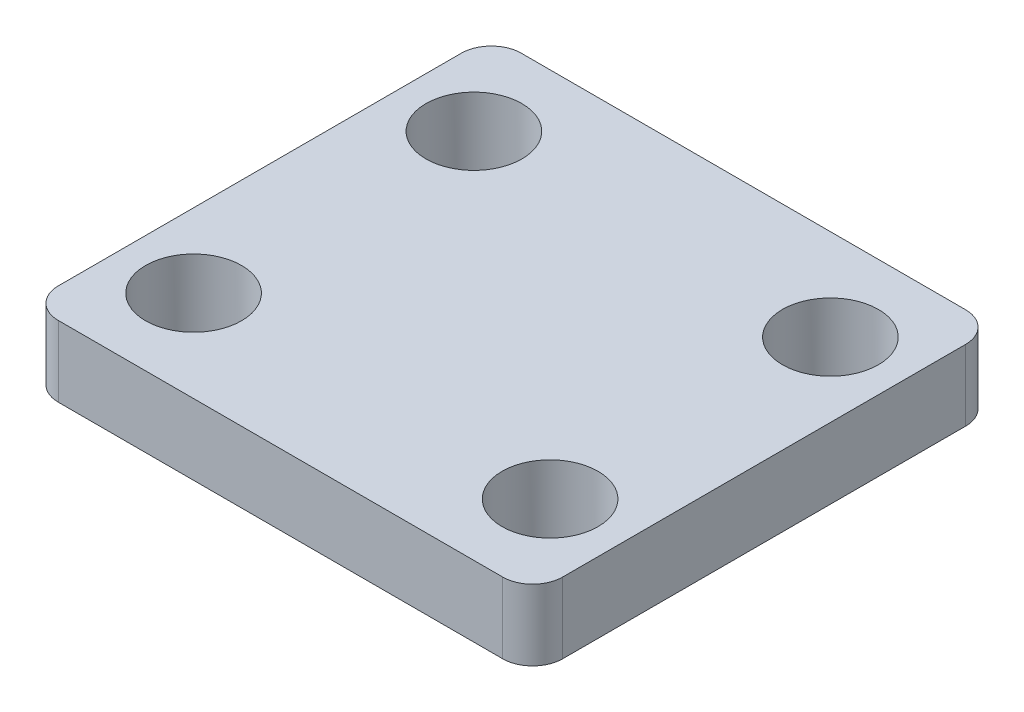
ISO-10303-21;
HEADER;
FILE_DESCRIPTION(('STEP AP214'),'2;1');
FILE_NAME('part.step','',(''),(''),'','','');
FILE_SCHEMA(('AUTOMOTIVE_DESIGN { 1 0 10303 214 1 1 1 1 }'));
ENDSEC;
DATA;
#1=APPLICATION_CONTEXT('core data for automotive mechanical design processes');
#2=APPLICATION_PROTOCOL_DEFINITION('international standard','automotive_design',2000,#1);
#3=PRODUCT_CONTEXT('',#1,'mechanical');
#4=PRODUCT('Part','Part','',(#3));
#5=PRODUCT_RELATED_PRODUCT_CATEGORY('part','',(#4));
#6=PRODUCT_DEFINITION_FORMATION('','',#4);
#7=PRODUCT_DEFINITION_CONTEXT('part definition',#1,'design');
#8=PRODUCT_DEFINITION('design','',#6,#7);
#9=PRODUCT_DEFINITION_SHAPE('','',#8);
#10=(LENGTH_UNIT() NAMED_UNIT(*) SI_UNIT(.MILLI.,.METRE.));
#11=(NAMED_UNIT(*) PLANE_ANGLE_UNIT() SI_UNIT($,.RADIAN.));
#12=(NAMED_UNIT(*) SI_UNIT($,.STERADIAN.) SOLID_ANGLE_UNIT());
#13=UNCERTAINTY_MEASURE_WITH_UNIT(LENGTH_MEASURE(1.E-05),#10,'distance_accuracy_value','');
#14=(GEOMETRIC_REPRESENTATION_CONTEXT(3) GLOBAL_UNCERTAINTY_ASSIGNED_CONTEXT((#13)) GLOBAL_UNIT_ASSIGNED_CONTEXT((#10,
#11,#12)) REPRESENTATION_CONTEXT('',''));
#15=CARTESIAN_POINT('',(0.,0.,0.));
#16=DIRECTION('',(0.,0.,1.));
#17=DIRECTION('',(1.,0.,0.));
#18=AXIS2_PLACEMENT_3D('',#15,#16,#17);
#19=CARTESIAN_POINT('',(21.3614,0.,-19.6088));
#20=DIRECTION('',(0.,0.,-1.));
#21=DIRECTION('',(-1.,0.,0.));
#22=AXIS2_PLACEMENT_3D('',#19,#20,#21);
#23=PLANE('',#22);
#24=DIRECTION('',(-1.,0.,0.));
#25=VECTOR('',#24,1.);
#26=CARTESIAN_POINT('',(21.3614,6.,-19.6088));
#27=LINE('',#26,#25);
#28=CARTESIAN_POINT('',(18.8214,6.,-19.6088));
#29=VERTEX_POINT('',#28);
#30=CARTESIAN_POINT('',(-18.8214,6.,-19.6088));
#31=VERTEX_POINT('',#30);
#32=EDGE_CURVE('E215',#29,#31,#27,.T.);
#33=ORIENTED_EDGE('',*,*,#32,.F.);
#34=DIRECTION('',(0.,1.,0.));
#35=VECTOR('',#34,1.);
#36=CARTESIAN_POINT('',(18.8214,0.,-19.6088));
#37=LINE('',#36,#35);
#38=CARTESIAN_POINT('',(18.8214,0.,-19.6088));
#39=VERTEX_POINT('',#38);
#40=EDGE_CURVE('E169',#29,#39,#37,.F.);
#41=ORIENTED_EDGE('',*,*,#40,.T.);
#42=DIRECTION('',(-1.,0.,0.));
#43=VECTOR('',#42,1.);
#44=CARTESIAN_POINT('',(21.3614,0.,-19.6088));
#45=LINE('',#44,#43);
#46=CARTESIAN_POINT('',(-18.8214,0.,-19.6088));
#47=VERTEX_POINT('',#46);
#48=EDGE_CURVE('E176',#39,#47,#45,.T.);
#49=ORIENTED_EDGE('',*,*,#48,.T.);
#50=DIRECTION('',(0.,1.,0.));
#51=VECTOR('',#50,1.);
#52=CARTESIAN_POINT('',(-18.8214,0.,-19.6088));
#53=LINE('',#52,#51);
#54=EDGE_CURVE('E165',#47,#31,#53,.T.);
#55=ORIENTED_EDGE('',*,*,#54,.T.);
#56=EDGE_LOOP('',(#33,#41,#49,#55));
#57=FACE_BOUND('',#56,.T.);
#58=ADVANCED_FACE('F39',(#57),#23,.T.);
#59=CARTESIAN_POINT('',(21.3614,0.,19.6088));
#60=DIRECTION('',(1.,0.,0.));
#61=DIRECTION('',(0.,0.,-1.));
#62=AXIS2_PLACEMENT_3D('',#59,#60,#61);
#63=PLANE('',#62);
#64=DIRECTION('',(0.,0.,-1.));
#65=VECTOR('',#64,1.);
#66=CARTESIAN_POINT('',(21.3614,6.,28.3553806415426));
#67=LINE('',#66,#65);
#68=CARTESIAN_POINT('',(21.3614,6.,17.0688));
#69=VERTEX_POINT('',#68);
#70=CARTESIAN_POINT('',(21.3614,6.,-17.0688));
#71=VERTEX_POINT('',#70);
#72=EDGE_CURVE('E106',#69,#71,#67,.T.);
#73=ORIENTED_EDGE('',*,*,#72,.F.);
#74=DIRECTION('',(0.,1.,0.));
#75=VECTOR('',#74,1.);
#76=CARTESIAN_POINT('',(21.3614,0.,17.0688));
#77=LINE('',#76,#75);
#78=CARTESIAN_POINT('',(21.3614,0.,17.0688));
#79=VERTEX_POINT('',#78);
#80=EDGE_CURVE('E116',#69,#79,#77,.F.);
#81=ORIENTED_EDGE('',*,*,#80,.T.);
#82=DIRECTION('',(0.,0.,-1.));
#83=VECTOR('',#82,1.);
#84=CARTESIAN_POINT('',(21.3614,0.,19.6088));
#85=LINE('',#84,#83);
#86=CARTESIAN_POINT('',(21.3614,0.,-17.0688));
#87=VERTEX_POINT('',#86);
#88=EDGE_CURVE('E147',#79,#87,#85,.T.);
#89=ORIENTED_EDGE('',*,*,#88,.T.);
#90=DIRECTION('',(0.,1.,0.));
#91=VECTOR('',#90,1.);
#92=CARTESIAN_POINT('',(21.3614,0.,-17.0688));
#93=LINE('',#92,#91);
#94=EDGE_CURVE('E118',#87,#71,#93,.T.);
#95=ORIENTED_EDGE('',*,*,#94,.T.);
#96=EDGE_LOOP('',(#73,#81,#89,#95));
#97=FACE_BOUND('',#96,.T.);
#98=ADVANCED_FACE('F114',(#97),#63,.T.);
#99=CARTESIAN_POINT('',(-21.3614,0.,19.6088));
#100=DIRECTION('',(0.,0.,1.));
#101=DIRECTION('',(1.,0.,0.));
#102=AXIS2_PLACEMENT_3D('',#99,#100,#101);
#103=PLANE('',#102);
#104=DIRECTION('',(1.,0.,0.));
#105=VECTOR('',#104,1.);
#106=CARTESIAN_POINT('',(-21.3614,6.,19.6088));
#107=LINE('',#106,#105);
#108=CARTESIAN_POINT('',(-18.8214,6.,19.6088));
#109=VERTEX_POINT('',#108);
#110=CARTESIAN_POINT('',(18.8214,6.,19.6088));
#111=VERTEX_POINT('',#110);
#112=EDGE_CURVE('E54',#109,#111,#107,.T.);
#113=ORIENTED_EDGE('',*,*,#112,.F.);
#114=DIRECTION('',(0.,1.,0.));
#115=VECTOR('',#114,1.);
#116=CARTESIAN_POINT('',(-18.8214,0.,19.6088));
#117=LINE('',#116,#115);
#118=CARTESIAN_POINT('',(-18.8214,0.,19.6088));
#119=VERTEX_POINT('',#118);
#120=EDGE_CURVE('E48',#109,#119,#117,.F.);
#121=ORIENTED_EDGE('',*,*,#120,.T.);
#122=DIRECTION('',(1.,0.,0.));
#123=VECTOR('',#122,1.);
#124=CARTESIAN_POINT('',(-21.3614,0.,19.6088));
#125=LINE('',#124,#123);
#126=CARTESIAN_POINT('',(18.8214,0.,19.6088));
#127=VERTEX_POINT('',#126);
#128=EDGE_CURVE('E138',#119,#127,#125,.T.);
#129=ORIENTED_EDGE('',*,*,#128,.T.);
#130=DIRECTION('',(0.,1.,0.));
#131=VECTOR('',#130,1.);
#132=CARTESIAN_POINT('',(18.8214,0.,19.6088));
#133=LINE('',#132,#131);
#134=EDGE_CURVE('E127',#127,#111,#133,.T.);
#135=ORIENTED_EDGE('',*,*,#134,.T.);
#136=EDGE_LOOP('',(#113,#121,#129,#135));
#137=FACE_BOUND('',#136,.T.);
#138=ADVANCED_FACE('F137',(#137),#103,.T.);
#139=CARTESIAN_POINT('',(-21.3614,0.,-19.6088));
#140=DIRECTION('',(-1.,0.,0.));
#141=DIRECTION('',(0.,0.,1.));
#142=AXIS2_PLACEMENT_3D('',#139,#140,#141);
#143=PLANE('',#142);
#144=DIRECTION('',(0.,0.,-1.));
#145=VECTOR('',#144,1.);
#146=CARTESIAN_POINT('',(-21.3614,6.,28.3553806415426));
#147=LINE('',#146,#145);
#148=CARTESIAN_POINT('',(-21.3614,6.,17.0688));
#149=VERTEX_POINT('',#148);
#150=CARTESIAN_POINT('',(-21.3614,6.,-17.0688));
#151=VERTEX_POINT('',#150);
#152=EDGE_CURVE('E120',#149,#151,#147,.T.);
#153=ORIENTED_EDGE('',*,*,#152,.T.);
#154=DIRECTION('',(0.,1.,0.));
#155=VECTOR('',#154,1.);
#156=CARTESIAN_POINT('',(-21.3614,0.,-17.0688));
#157=LINE('',#156,#155);
#158=CARTESIAN_POINT('',(-21.3614,0.,-17.0688));
#159=VERTEX_POINT('',#158);
#160=EDGE_CURVE('E158',#151,#159,#157,.F.);
#161=ORIENTED_EDGE('',*,*,#160,.T.);
#162=DIRECTION('',(0.,0.,1.));
#163=VECTOR('',#162,1.);
#164=CARTESIAN_POINT('',(-21.3614,0.,-19.6088));
#165=LINE('',#164,#163);
#166=CARTESIAN_POINT('',(-21.3614,0.,17.0688));
#167=VERTEX_POINT('',#166);
#168=EDGE_CURVE('E148',#159,#167,#165,.T.);
#169=ORIENTED_EDGE('',*,*,#168,.T.);
#170=DIRECTION('',(0.,1.,0.));
#171=VECTOR('',#170,1.);
#172=CARTESIAN_POINT('',(-21.3614,0.,17.0688));
#173=LINE('',#172,#171);
#174=EDGE_CURVE('E153',#167,#149,#173,.T.);
#175=ORIENTED_EDGE('',*,*,#174,.T.);
#176=EDGE_LOOP('',(#153,#161,#169,#175));
#177=FACE_BOUND('',#176,.T.);
#178=ADVANCED_FACE('F230',(#177),#143,.T.);
#179=CARTESIAN_POINT('',(0.,0.,0.));
#180=DIRECTION('',(0.,1.,0.));
#181=DIRECTION('',(0.,0.,1.));
#182=AXIS2_PLACEMENT_3D('',#179,#180,#181);
#183=PLANE('',#182);
#184=CARTESIAN_POINT('',(15.1003,0.,11.8745));
#185=DIRECTION('',(0.,1.,0.));
#186=DIRECTION('',(0.,0.,1.));
#187=AXIS2_PLACEMENT_3D('',#184,#185,#186);
#188=CIRCLE('',#187,4.06400000000003);
#189=CARTESIAN_POINT('',(15.1003,0.,15.9385));
#190=VERTEX_POINT('',#189);
#191=EDGE_CURVE('E192',#190,#190,#188,.T.);
#192=ORIENTED_EDGE('',*,*,#191,.T.);
#193=EDGE_LOOP('',(#192));
#194=FACE_BOUND('',#193,.T.);
#195=CARTESIAN_POINT('',(-15.1003,0.,-11.8745));
#196=DIRECTION('',(0.,1.,0.));
#197=DIRECTION('',(0.,0.,1.));
#198=AXIS2_PLACEMENT_3D('',#195,#196,#197);
#199=CIRCLE('',#198,4.06400000000003);
#200=CARTESIAN_POINT('',(-15.1003,0.,-7.81049999999997));
#201=VERTEX_POINT('',#200);
#202=EDGE_CURVE('E188',#201,#201,#199,.T.);
#203=ORIENTED_EDGE('',*,*,#202,.T.);
#204=EDGE_LOOP('',(#203));
#205=FACE_BOUND('',#204,.T.);
#206=CARTESIAN_POINT('',(15.1003,0.,-11.8745));
#207=DIRECTION('',(0.,1.,0.));
#208=DIRECTION('',(0.,0.,1.));
#209=AXIS2_PLACEMENT_3D('',#206,#207,#208);
#210=CIRCLE('',#209,4.06400000000003);
#211=CARTESIAN_POINT('',(15.1003,0.,-7.81049999999997));
#212=VERTEX_POINT('',#211);
#213=EDGE_CURVE('E184',#212,#212,#210,.T.);
#214=ORIENTED_EDGE('',*,*,#213,.T.);
#215=EDGE_LOOP('',(#214));
#216=FACE_BOUND('',#215,.T.);
#217=CARTESIAN_POINT('',(-15.1003,0.,11.8745));
#218=DIRECTION('',(0.,1.,0.));
#219=DIRECTION('',(0.,0.,1.));
#220=AXIS2_PLACEMENT_3D('',#217,#218,#219);
#221=CIRCLE('',#220,4.06400000000003);
#222=CARTESIAN_POINT('',(-15.1003,0.,15.9385));
#223=VERTEX_POINT('',#222);
#224=EDGE_CURVE('E180',#223,#223,#221,.T.);
#225=ORIENTED_EDGE('',*,*,#224,.T.);
#226=EDGE_LOOP('',(#225));
#227=FACE_BOUND('',#226,.T.);
#228=ORIENTED_EDGE('',*,*,#168,.F.);
#229=CARTESIAN_POINT('',(-18.8214,0.,-17.0688));
#230=DIRECTION('',(0.,1.,0.));
#231=DIRECTION('',(0.,0.,1.));
#232=AXIS2_PLACEMENT_3D('',#229,#230,#231);
#233=CIRCLE('',#232,2.54);
#234=EDGE_CURVE('E123',#159,#47,#233,.F.);
#235=ORIENTED_EDGE('',*,*,#234,.T.);
#236=ORIENTED_EDGE('',*,*,#48,.F.);
#237=CARTESIAN_POINT('',(18.8214,0.,-17.0688));
#238=DIRECTION('',(0.,1.,0.));
#239=DIRECTION('',(0.,0.,1.));
#240=AXIS2_PLACEMENT_3D('',#237,#238,#239);
#241=CIRCLE('',#240,2.54);
#242=EDGE_CURVE('E129',#39,#87,#241,.F.);
#243=ORIENTED_EDGE('',*,*,#242,.T.);
#244=ORIENTED_EDGE('',*,*,#88,.F.);
#245=CARTESIAN_POINT('',(18.8214,0.,17.0688));
#246=DIRECTION('',(0.,1.,0.));
#247=DIRECTION('',(0.,0.,1.));
#248=AXIS2_PLACEMENT_3D('',#245,#246,#247);
#249=CIRCLE('',#248,2.54);
#250=EDGE_CURVE('E62',#79,#127,#249,.F.);
#251=ORIENTED_EDGE('',*,*,#250,.T.);
#252=ORIENTED_EDGE('',*,*,#128,.F.);
#253=CARTESIAN_POINT('',(-18.8214,0.,17.0688));
#254=DIRECTION('',(0.,1.,0.));
#255=DIRECTION('',(0.,0.,1.));
#256=AXIS2_PLACEMENT_3D('',#253,#254,#255);
#257=CIRCLE('',#256,2.54);
#258=EDGE_CURVE('E144',#119,#167,#257,.F.);
#259=ORIENTED_EDGE('',*,*,#258,.T.);
#260=EDGE_LOOP('',(#228,#235,#236,#243,#244,#251,#252,#259));
#261=FACE_BOUND('',#260,.T.);
#262=ADVANCED_FACE('F143',(#194,#205,#216,#227,#261),#183,.F.);
#263=CARTESIAN_POINT('',(-15.1003,12.573,11.8745));
#264=DIRECTION('',(0.,1.,0.));
#265=DIRECTION('',(0.,0.,1.));
#266=AXIS2_PLACEMENT_3D('',#263,#264,#265);
#267=CYLINDRICAL_SURFACE('',#266,4.06400000000003);
#268=CARTESIAN_POINT('',(-15.1003,6.,11.8745));
#269=DIRECTION('',(0.,-1.,0.));
#270=DIRECTION('',(0.,0.,-1.));
#271=AXIS2_PLACEMENT_3D('',#268,#269,#270);
#272=CIRCLE('',#271,4.06400000000003);
#273=CARTESIAN_POINT('',(-15.1003,6.,7.81049999999997));
#274=VERTEX_POINT('',#273);
#275=EDGE_CURVE('E196',#274,#274,#272,.F.);
#276=ORIENTED_EDGE('',*,*,#275,.T.);
#277=EDGE_LOOP('',(#276));
#278=FACE_BOUND('',#277,.T.);
#279=ORIENTED_EDGE('',*,*,#224,.F.);
#280=EDGE_LOOP('',(#279));
#281=FACE_BOUND('',#280,.T.);
#282=ADVANCED_FACE('F264',(#278,#281),#267,.F.);
#283=CARTESIAN_POINT('',(15.1003,12.573,-11.8745));
#284=DIRECTION('',(0.,1.,0.));
#285=DIRECTION('',(0.,0.,1.));
#286=AXIS2_PLACEMENT_3D('',#283,#284,#285);
#287=CYLINDRICAL_SURFACE('',#286,4.06400000000003);
#288=CARTESIAN_POINT('',(15.1003,6.,-11.8745));
#289=DIRECTION('',(0.,-1.,0.));
#290=DIRECTION('',(0.,0.,-1.));
#291=AXIS2_PLACEMENT_3D('',#288,#289,#290);
#292=CIRCLE('',#291,4.06400000000003);
#293=CARTESIAN_POINT('',(15.1003,6.,-15.9385));
#294=VERTEX_POINT('',#293);
#295=EDGE_CURVE('E200',#294,#294,#292,.F.);
#296=ORIENTED_EDGE('',*,*,#295,.T.);
#297=EDGE_LOOP('',(#296));
#298=FACE_BOUND('',#297,.T.);
#299=ORIENTED_EDGE('',*,*,#213,.F.);
#300=EDGE_LOOP('',(#299));
#301=FACE_BOUND('',#300,.T.);
#302=ADVANCED_FACE('F268',(#298,#301),#287,.F.);
#303=CARTESIAN_POINT('',(-15.1003,12.573,-11.8745));
#304=DIRECTION('',(0.,1.,0.));
#305=DIRECTION('',(0.,0.,1.));
#306=AXIS2_PLACEMENT_3D('',#303,#304,#305);
#307=CYLINDRICAL_SURFACE('',#306,4.06400000000003);
#308=CARTESIAN_POINT('',(-15.1003,6.,-11.8745));
#309=DIRECTION('',(0.,-1.,0.));
#310=DIRECTION('',(0.,0.,-1.));
#311=AXIS2_PLACEMENT_3D('',#308,#309,#310);
#312=CIRCLE('',#311,4.06400000000003);
#313=CARTESIAN_POINT('',(-15.1003,6.,-15.9385));
#314=VERTEX_POINT('',#313);
#315=EDGE_CURVE('E204',#314,#314,#312,.F.);
#316=ORIENTED_EDGE('',*,*,#315,.T.);
#317=EDGE_LOOP('',(#316));
#318=FACE_BOUND('',#317,.T.);
#319=ORIENTED_EDGE('',*,*,#202,.F.);
#320=EDGE_LOOP('',(#319));
#321=FACE_BOUND('',#320,.T.);
#322=ADVANCED_FACE('F272',(#318,#321),#307,.F.);
#323=CARTESIAN_POINT('',(15.1003,12.573,11.8745));
#324=DIRECTION('',(0.,1.,0.));
#325=DIRECTION('',(0.,0.,1.));
#326=AXIS2_PLACEMENT_3D('',#323,#324,#325);
#327=CYLINDRICAL_SURFACE('',#326,4.06400000000003);
#328=CARTESIAN_POINT('',(15.1003,6.,11.8745));
#329=DIRECTION('',(0.,-1.,0.));
#330=DIRECTION('',(0.,0.,-1.));
#331=AXIS2_PLACEMENT_3D('',#328,#329,#330);
#332=CIRCLE('',#331,4.06400000000003);
#333=CARTESIAN_POINT('',(15.1003,6.,7.81049999999996));
#334=VERTEX_POINT('',#333);
#335=EDGE_CURVE('E208',#334,#334,#332,.F.);
#336=ORIENTED_EDGE('',*,*,#335,.T.);
#337=EDGE_LOOP('',(#336));
#338=FACE_BOUND('',#337,.T.);
#339=ORIENTED_EDGE('',*,*,#191,.F.);
#340=EDGE_LOOP('',(#339));
#341=FACE_BOUND('',#340,.T.);
#342=ADVANCED_FACE('F249',(#338,#341),#327,.F.);
#343=CARTESIAN_POINT('',(-18.8214,0.,-17.0688));
#344=DIRECTION('',(0.,1.,0.));
#345=DIRECTION('',(0.,0.,1.));
#346=AXIS2_PLACEMENT_3D('',#343,#344,#345);
#347=CYLINDRICAL_SURFACE('',#346,2.54);
#348=CARTESIAN_POINT('',(-18.8214,6.,-17.0688));
#349=DIRECTION('',(0.,-1.,0.));
#350=DIRECTION('',(0.,0.,-1.));
#351=AXIS2_PLACEMENT_3D('',#348,#349,#350);
#352=CIRCLE('',#351,2.54);
#353=EDGE_CURVE('E212',#31,#151,#352,.F.);
#354=ORIENTED_EDGE('',*,*,#353,.F.);
#355=ORIENTED_EDGE('',*,*,#54,.F.);
#356=ORIENTED_EDGE('',*,*,#234,.F.);
#357=ORIENTED_EDGE('',*,*,#160,.F.);
#358=EDGE_LOOP('',(#354,#355,#356,#357));
#359=FACE_BOUND('',#358,.T.);
#360=ADVANCED_FACE('F234',(#359),#347,.T.);
#361=CARTESIAN_POINT('',(18.8214,0.,-17.0688));
#362=DIRECTION('',(0.,1.,0.));
#363=DIRECTION('',(0.,0.,1.));
#364=AXIS2_PLACEMENT_3D('',#361,#362,#363);
#365=CYLINDRICAL_SURFACE('',#364,2.54);
#366=CARTESIAN_POINT('',(18.8214,6.,-17.0688));
#367=DIRECTION('',(0.,-1.,0.));
#368=DIRECTION('',(0.,0.,-1.));
#369=AXIS2_PLACEMENT_3D('',#366,#367,#368);
#370=CIRCLE('',#369,2.54);
#371=EDGE_CURVE('E218',#71,#29,#370,.F.);
#372=ORIENTED_EDGE('',*,*,#371,.F.);
#373=ORIENTED_EDGE('',*,*,#94,.F.);
#374=ORIENTED_EDGE('',*,*,#242,.F.);
#375=ORIENTED_EDGE('',*,*,#40,.F.);
#376=EDGE_LOOP('',(#372,#373,#374,#375));
#377=FACE_BOUND('',#376,.T.);
#378=ADVANCED_FACE('F242',(#377),#365,.T.);
#379=CARTESIAN_POINT('',(-18.8214,0.,17.0688));
#380=DIRECTION('',(0.,1.,0.));
#381=DIRECTION('',(0.,0.,1.));
#382=AXIS2_PLACEMENT_3D('',#379,#380,#381);
#383=CYLINDRICAL_SURFACE('',#382,2.54);
#384=CARTESIAN_POINT('',(-18.8214,6.,17.0688));
#385=DIRECTION('',(0.,-1.,0.));
#386=DIRECTION('',(0.,0.,-1.));
#387=AXIS2_PLACEMENT_3D('',#384,#385,#386);
#388=CIRCLE('',#387,2.54);
#389=EDGE_CURVE('E221',#149,#109,#388,.F.);
#390=ORIENTED_EDGE('',*,*,#389,.F.);
#391=ORIENTED_EDGE('',*,*,#174,.F.);
#392=ORIENTED_EDGE('',*,*,#258,.F.);
#393=ORIENTED_EDGE('',*,*,#120,.F.);
#394=EDGE_LOOP('',(#390,#391,#392,#393));
#395=FACE_BOUND('',#394,.T.);
#396=ADVANCED_FACE('F151',(#395),#383,.T.);
#397=CARTESIAN_POINT('',(18.8214,0.,17.0688));
#398=DIRECTION('',(0.,1.,0.));
#399=DIRECTION('',(0.,0.,1.));
#400=AXIS2_PLACEMENT_3D('',#397,#398,#399);
#401=CYLINDRICAL_SURFACE('',#400,2.54);
#402=CARTESIAN_POINT('',(18.8214,6.,17.0688));
#403=DIRECTION('',(0.,-1.,0.));
#404=DIRECTION('',(0.,0.,-1.));
#405=AXIS2_PLACEMENT_3D('',#402,#403,#404);
#406=CIRCLE('',#405,2.54);
#407=EDGE_CURVE('E11',#111,#69,#406,.F.);
#408=ORIENTED_EDGE('',*,*,#407,.F.);
#409=ORIENTED_EDGE('',*,*,#134,.F.);
#410=ORIENTED_EDGE('',*,*,#250,.F.);
#411=ORIENTED_EDGE('',*,*,#80,.F.);
#412=EDGE_LOOP('',(#408,#409,#410,#411));
#413=FACE_BOUND('',#412,.T.);
#414=ADVANCED_FACE('F41',(#413),#401,.T.);
#415=CARTESIAN_POINT('',(-21.3614,6.,28.3553806415426));
#416=DIRECTION('',(0.,-1.,0.));
#417=DIRECTION('',(0.,0.,-1.));
#418=AXIS2_PLACEMENT_3D('',#415,#416,#417);
#419=PLANE('',#418);
#420=ORIENTED_EDGE('',*,*,#295,.F.);
#421=EDGE_LOOP('',(#420));
#422=FACE_BOUND('',#421,.T.);
#423=ORIENTED_EDGE('',*,*,#335,.F.);
#424=EDGE_LOOP('',(#423));
#425=FACE_BOUND('',#424,.T.);
#426=ORIENTED_EDGE('',*,*,#353,.T.);
#427=ORIENTED_EDGE('',*,*,#152,.F.);
#428=ORIENTED_EDGE('',*,*,#389,.T.);
#429=ORIENTED_EDGE('',*,*,#112,.T.);
#430=ORIENTED_EDGE('',*,*,#407,.T.);
#431=ORIENTED_EDGE('',*,*,#72,.T.);
#432=ORIENTED_EDGE('',*,*,#371,.T.);
#433=ORIENTED_EDGE('',*,*,#32,.T.);
#434=EDGE_LOOP('',(#426,#427,#428,#429,#430,#431,#432,#433));
#435=FACE_BOUND('',#434,.T.);
#436=ORIENTED_EDGE('',*,*,#315,.F.);
#437=EDGE_LOOP('',(#436));
#438=FACE_BOUND('',#437,.T.);
#439=ORIENTED_EDGE('',*,*,#275,.F.);
#440=EDGE_LOOP('',(#439));
#441=FACE_BOUND('',#440,.T.);
#442=ADVANCED_FACE('F104',(#422,#425,#435,#438,#441),#419,.F.);
#443=CLOSED_SHELL('',(#58,#98,#138,#178,#262,#282,#302,#322,#342,#360,#378,#396,#414,#442));
#444=MANIFOLD_SOLID_BREP('B2',#443);
#445=ADVANCED_BREP_SHAPE_REPRESENTATION('',(#18,#444),#14);
#446=SHAPE_DEFINITION_REPRESENTATION(#9,#445);
ENDSEC;
END-ISO-10303-21;
